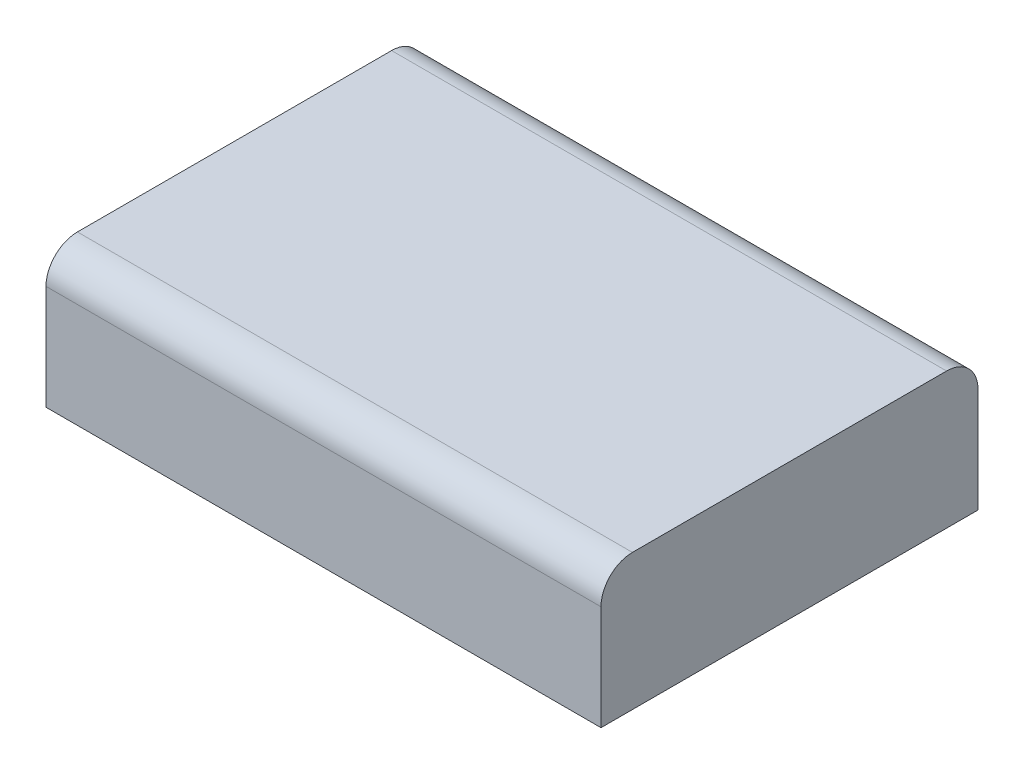
ISO-10303-21;
HEADER;
FILE_DESCRIPTION(('STEP AP214'),'2;1');
FILE_NAME('part.step','',(''),(''),'','','');
FILE_SCHEMA(('AUTOMOTIVE_DESIGN { 1 0 10303 214 1 1 1 1 }'));
ENDSEC;
DATA;
#1=APPLICATION_CONTEXT('core data for automotive mechanical design processes');
#2=APPLICATION_PROTOCOL_DEFINITION('international standard','automotive_design',2000,#1);
#3=PRODUCT_CONTEXT('',#1,'mechanical');
#4=PRODUCT('Part','Part','',(#3));
#5=PRODUCT_RELATED_PRODUCT_CATEGORY('part','',(#4));
#6=PRODUCT_DEFINITION_FORMATION('','',#4);
#7=PRODUCT_DEFINITION_CONTEXT('part definition',#1,'design');
#8=PRODUCT_DEFINITION('design','',#6,#7);
#9=PRODUCT_DEFINITION_SHAPE('','',#8);
#10=(LENGTH_UNIT() NAMED_UNIT(*) SI_UNIT(.MILLI.,.METRE.));
#11=(NAMED_UNIT(*) PLANE_ANGLE_UNIT() SI_UNIT($,.RADIAN.));
#12=(NAMED_UNIT(*) SI_UNIT($,.STERADIAN.) SOLID_ANGLE_UNIT());
#13=UNCERTAINTY_MEASURE_WITH_UNIT(LENGTH_MEASURE(1.E-05),#10,'distance_accuracy_value','');
#14=(GEOMETRIC_REPRESENTATION_CONTEXT(3) GLOBAL_UNCERTAINTY_ASSIGNED_CONTEXT((#13)) GLOBAL_UNIT_ASSIGNED_CONTEXT((#10,
#11,#12)) REPRESENTATION_CONTEXT('',''));
#15=CARTESIAN_POINT('',(0.,0.,0.));
#16=DIRECTION('',(0.,0.,1.));
#17=DIRECTION('',(1.,0.,0.));
#18=AXIS2_PLACEMENT_3D('',#15,#16,#17);
#19=CARTESIAN_POINT('',(-26.5,13.,-18.));
#20=DIRECTION('',(0.,0.,1.));
#21=DIRECTION('',(1.,0.,0.));
#22=AXIS2_PLACEMENT_3D('',#19,#20,#21);
#23=PLANE('',#22);
#24=DIRECTION('',(1.,0.,0.));
#25=VECTOR('',#24,1.);
#26=CARTESIAN_POINT('',(-26.5,9.99999999999998,-18.));
#27=LINE('',#26,#25);
#28=CARTESIAN_POINT('',(-26.5,9.99999999999998,-18.));
#29=VERTEX_POINT('',#28);
#30=CARTESIAN_POINT('',(26.5,9.99999999999998,-18.));
#31=VERTEX_POINT('',#30);
#32=EDGE_CURVE('E138',#29,#31,#27,.T.);
#33=ORIENTED_EDGE('',*,*,#32,.T.);
#34=DIRECTION('',(0.,-1.,0.));
#35=VECTOR('',#34,1.);
#36=CARTESIAN_POINT('',(26.5,13.,-18.));
#37=LINE('',#36,#35);
#38=CARTESIAN_POINT('',(26.5,0.,-18.));
#39=VERTEX_POINT('',#38);
#40=EDGE_CURVE('E11',#31,#39,#37,.T.);
#41=ORIENTED_EDGE('',*,*,#40,.T.);
#42=DIRECTION('',(-1.,0.,0.));
#43=VECTOR('',#42,1.);
#44=CARTESIAN_POINT('',(-26.5,0.,-18.));
#45=LINE('',#44,#43);
#46=CARTESIAN_POINT('',(-26.5,0.,-18.));
#47=VERTEX_POINT('',#46);
#48=EDGE_CURVE('E114',#39,#47,#45,.T.);
#49=ORIENTED_EDGE('',*,*,#48,.T.);
#50=DIRECTION('',(0.,-1.,0.));
#51=VECTOR('',#50,1.);
#52=CARTESIAN_POINT('',(-26.5,13.,-18.));
#53=LINE('',#52,#51);
#54=EDGE_CURVE('E41',#29,#47,#53,.T.);
#55=ORIENTED_EDGE('',*,*,#54,.F.);
#56=EDGE_LOOP('',(#33,#41,#49,#55));
#57=FACE_BOUND('',#56,.T.);
#58=ADVANCED_FACE('F33',(#57),#23,.F.);
#59=CARTESIAN_POINT('',(0.,13.,0.));
#60=DIRECTION('',(0.,-1.,0.));
#61=DIRECTION('',(0.,0.,-1.));
#62=AXIS2_PLACEMENT_3D('',#59,#60,#61);
#63=PLANE('',#62);
#64=DIRECTION('',(1.,0.,0.));
#65=VECTOR('',#64,1.);
#66=CARTESIAN_POINT('',(-26.5,13.,15.));
#67=LINE('',#66,#65);
#68=CARTESIAN_POINT('',(-26.5,13.,15.));
#69=VERTEX_POINT('',#68);
#70=CARTESIAN_POINT('',(26.5,13.,15.));
#71=VERTEX_POINT('',#70);
#72=EDGE_CURVE('E82',#69,#71,#67,.T.);
#73=ORIENTED_EDGE('',*,*,#72,.T.);
#74=DIRECTION('',(0.,0.,-1.));
#75=VECTOR('',#74,1.);
#76=CARTESIAN_POINT('',(26.5,13.,18.));
#77=LINE('',#76,#75);
#78=CARTESIAN_POINT('',(26.5,13.,-15.));
#79=VERTEX_POINT('',#78);
#80=EDGE_CURVE('E104',#71,#79,#77,.T.);
#81=ORIENTED_EDGE('',*,*,#80,.T.);
#82=DIRECTION('',(1.,0.,0.));
#83=VECTOR('',#82,1.);
#84=CARTESIAN_POINT('',(-26.5,13.,-15.));
#85=LINE('',#84,#83);
#86=CARTESIAN_POINT('',(-26.5,13.,-15.));
#87=VERTEX_POINT('',#86);
#88=EDGE_CURVE('E102',#87,#79,#85,.T.);
#89=ORIENTED_EDGE('',*,*,#88,.F.);
#90=DIRECTION('',(0.,0.,1.));
#91=VECTOR('',#90,1.);
#92=CARTESIAN_POINT('',(-26.5,13.,18.));
#93=LINE('',#92,#91);
#94=EDGE_CURVE('E97',#87,#69,#93,.T.);
#95=ORIENTED_EDGE('',*,*,#94,.T.);
#96=EDGE_LOOP('',(#73,#81,#89,#95));
#97=FACE_BOUND('',#96,.T.);
#98=ADVANCED_FACE('F101',(#97),#63,.F.);
#99=CARTESIAN_POINT('',(26.5,13.,18.));
#100=DIRECTION('',(-1.,0.,0.));
#101=DIRECTION('',(0.,0.,1.));
#102=AXIS2_PLACEMENT_3D('',#99,#100,#101);
#103=PLANE('',#102);
#104=ORIENTED_EDGE('',*,*,#80,.F.);
#105=CARTESIAN_POINT('',(26.5,10.,15.));
#106=DIRECTION('',(-1.,0.,0.));
#107=DIRECTION('',(0.,0.,-1.));
#108=AXIS2_PLACEMENT_3D('',#105,#106,#107);
#109=CIRCLE('',#108,3.);
#110=CARTESIAN_POINT('',(26.5,9.99999999999998,18.));
#111=VERTEX_POINT('',#110);
#112=EDGE_CURVE('E56',#111,#71,#109,.T.);
#113=ORIENTED_EDGE('',*,*,#112,.F.);
#114=DIRECTION('',(0.,-1.,0.));
#115=VECTOR('',#114,1.);
#116=CARTESIAN_POINT('',(26.5,13.,18.));
#117=LINE('',#116,#115);
#118=CARTESIAN_POINT('',(26.5,0.,18.));
#119=VERTEX_POINT('',#118);
#120=EDGE_CURVE('E103',#111,#119,#117,.T.);
#121=ORIENTED_EDGE('',*,*,#120,.T.);
#122=DIRECTION('',(0.,0.,-1.));
#123=VECTOR('',#122,1.);
#124=CARTESIAN_POINT('',(26.5,0.,18.));
#125=LINE('',#124,#123);
#126=EDGE_CURVE('E111',#119,#39,#125,.T.);
#127=ORIENTED_EDGE('',*,*,#126,.T.);
#128=ORIENTED_EDGE('',*,*,#40,.F.);
#129=CARTESIAN_POINT('',(26.5,10.,-15.));
#130=DIRECTION('',(-1.,0.,0.));
#131=DIRECTION('',(0.,0.,-1.));
#132=AXIS2_PLACEMENT_3D('',#129,#130,#131);
#133=CIRCLE('',#132,3.);
#134=EDGE_CURVE('E139',#79,#31,#133,.T.);
#135=ORIENTED_EDGE('',*,*,#134,.F.);
#136=EDGE_LOOP('',(#104,#113,#121,#127,#128,#135));
#137=FACE_BOUND('',#136,.T.);
#138=ADVANCED_FACE('F35',(#137),#103,.F.);
#139=CARTESIAN_POINT('',(-26.5,13.,18.));
#140=DIRECTION('',(1.,0.,0.));
#141=DIRECTION('',(0.,0.,-1.));
#142=AXIS2_PLACEMENT_3D('',#139,#140,#141);
#143=PLANE('',#142);
#144=DIRECTION('',(0.,-1.,0.));
#145=VECTOR('',#144,1.);
#146=CARTESIAN_POINT('',(-26.5,13.,18.));
#147=LINE('',#146,#145);
#148=CARTESIAN_POINT('',(-26.5,9.99999999999998,18.));
#149=VERTEX_POINT('',#148);
#150=CARTESIAN_POINT('',(-26.5,0.,18.));
#151=VERTEX_POINT('',#150);
#152=EDGE_CURVE('E99',#149,#151,#147,.T.);
#153=ORIENTED_EDGE('',*,*,#152,.F.);
#154=CARTESIAN_POINT('',(-26.5,10.,15.));
#155=DIRECTION('',(-1.,0.,0.));
#156=DIRECTION('',(0.,0.,-1.));
#157=AXIS2_PLACEMENT_3D('',#154,#155,#156);
#158=CIRCLE('',#157,3.);
#159=EDGE_CURVE('E85',#149,#69,#158,.T.);
#160=ORIENTED_EDGE('',*,*,#159,.T.);
#161=ORIENTED_EDGE('',*,*,#94,.F.);
#162=CARTESIAN_POINT('',(-26.5,10.,-15.));
#163=DIRECTION('',(-1.,0.,0.));
#164=DIRECTION('',(0.,0.,-1.));
#165=AXIS2_PLACEMENT_3D('',#162,#163,#164);
#166=CIRCLE('',#165,3.);
#167=EDGE_CURVE('E48',#87,#29,#166,.T.);
#168=ORIENTED_EDGE('',*,*,#167,.T.);
#169=ORIENTED_EDGE('',*,*,#54,.T.);
#170=DIRECTION('',(0.,0.,1.));
#171=VECTOR('',#170,1.);
#172=CARTESIAN_POINT('',(-26.5,0.,18.));
#173=LINE('',#172,#171);
#174=EDGE_CURVE('E117',#47,#151,#173,.T.);
#175=ORIENTED_EDGE('',*,*,#174,.T.);
#176=EDGE_LOOP('',(#153,#160,#161,#168,#169,#175));
#177=FACE_BOUND('',#176,.T.);
#178=ADVANCED_FACE('F96',(#177),#143,.F.);
#179=CARTESIAN_POINT('',(-26.5,13.,18.));
#180=DIRECTION('',(0.,0.,-1.));
#181=DIRECTION('',(-1.,0.,0.));
#182=AXIS2_PLACEMENT_3D('',#179,#180,#181);
#183=PLANE('',#182);
#184=ORIENTED_EDGE('',*,*,#120,.F.);
#185=DIRECTION('',(1.,0.,0.));
#186=VECTOR('',#185,1.);
#187=CARTESIAN_POINT('',(-26.5,9.99999999999998,18.));
#188=LINE('',#187,#186);
#189=EDGE_CURVE('E91',#149,#111,#188,.T.);
#190=ORIENTED_EDGE('',*,*,#189,.F.);
#191=ORIENTED_EDGE('',*,*,#152,.T.);
#192=DIRECTION('',(1.,0.,0.));
#193=VECTOR('',#192,1.);
#194=CARTESIAN_POINT('',(-26.5,0.,18.));
#195=LINE('',#194,#193);
#196=EDGE_CURVE('E107',#151,#119,#195,.T.);
#197=ORIENTED_EDGE('',*,*,#196,.T.);
#198=EDGE_LOOP('',(#184,#190,#191,#197));
#199=FACE_BOUND('',#198,.T.);
#200=ADVANCED_FACE('F133',(#199),#183,.F.);
#201=CARTESIAN_POINT('',(0.,0.,0.));
#202=DIRECTION('',(0.,-1.,0.));
#203=DIRECTION('',(0.,0.,-1.));
#204=AXIS2_PLACEMENT_3D('',#201,#202,#203);
#205=PLANE('',#204);
#206=ORIENTED_EDGE('',*,*,#126,.F.);
#207=ORIENTED_EDGE('',*,*,#196,.F.);
#208=ORIENTED_EDGE('',*,*,#174,.F.);
#209=ORIENTED_EDGE('',*,*,#48,.F.);
#210=EDGE_LOOP('',(#206,#207,#208,#209));
#211=FACE_BOUND('',#210,.T.);
#212=ADVANCED_FACE('F130',(#211),#205,.T.);
#213=CARTESIAN_POINT('',(-26.5,10.,-15.));
#214=DIRECTION('',(1.,0.,0.));
#215=DIRECTION('',(0.,0.,-1.));
#216=AXIS2_PLACEMENT_3D('',#213,#214,#215);
#217=CYLINDRICAL_SURFACE('',#216,3.);
#218=ORIENTED_EDGE('',*,*,#134,.T.);
#219=ORIENTED_EDGE('',*,*,#32,.F.);
#220=ORIENTED_EDGE('',*,*,#167,.F.);
#221=ORIENTED_EDGE('',*,*,#88,.T.);
#222=EDGE_LOOP('',(#218,#219,#220,#221));
#223=FACE_BOUND('',#222,.T.);
#224=ADVANCED_FACE('F143',(#223),#217,.T.);
#225=CARTESIAN_POINT('',(-26.5,10.,15.));
#226=DIRECTION('',(1.,0.,0.));
#227=DIRECTION('',(0.,0.,-1.));
#228=AXIS2_PLACEMENT_3D('',#225,#226,#227);
#229=CYLINDRICAL_SURFACE('',#228,3.);
#230=ORIENTED_EDGE('',*,*,#112,.T.);
#231=ORIENTED_EDGE('',*,*,#72,.F.);
#232=ORIENTED_EDGE('',*,*,#159,.F.);
#233=ORIENTED_EDGE('',*,*,#189,.T.);
#234=EDGE_LOOP('',(#230,#231,#232,#233));
#235=FACE_BOUND('',#234,.T.);
#236=ADVANCED_FACE('F84',(#235),#229,.T.);
#237=CLOSED_SHELL('',(#58,#98,#138,#178,#200,#212,#224,#236));
#238=MANIFOLD_SOLID_BREP('B2',#237);
#239=ADVANCED_BREP_SHAPE_REPRESENTATION('',(#18,#238),#14);
#240=SHAPE_DEFINITION_REPRESENTATION(#9,#239);
ENDSEC;
END-ISO-10303-21;
